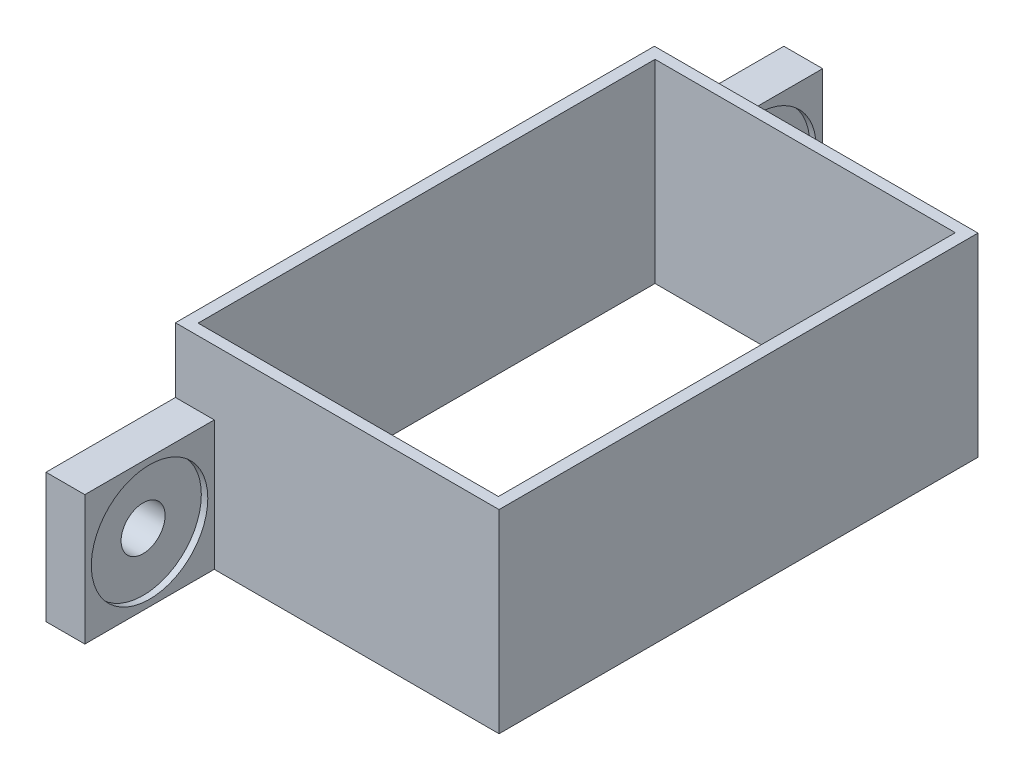
ISO-10303-21;
HEADER;
FILE_DESCRIPTION(('STEP AP214'),'2;1');
FILE_NAME('part.step','',(''),(''),'','','');
FILE_SCHEMA(('AUTOMOTIVE_DESIGN { 1 0 10303 214 1 1 1 1 }'));
ENDSEC;
DATA;
#1=APPLICATION_CONTEXT('core data for automotive mechanical design processes');
#2=APPLICATION_PROTOCOL_DEFINITION('international standard','automotive_design',2000,#1);
#3=PRODUCT_CONTEXT('',#1,'mechanical');
#4=PRODUCT('Part','Part','',(#3));
#5=PRODUCT_RELATED_PRODUCT_CATEGORY('part','',(#4));
#6=PRODUCT_DEFINITION_FORMATION('','',#4);
#7=PRODUCT_DEFINITION_CONTEXT('part definition',#1,'design');
#8=PRODUCT_DEFINITION('design','',#6,#7);
#9=PRODUCT_DEFINITION_SHAPE('','',#8);
#10=(LENGTH_UNIT() NAMED_UNIT(*) SI_UNIT(.MILLI.,.METRE.));
#11=(NAMED_UNIT(*) PLANE_ANGLE_UNIT() SI_UNIT($,.RADIAN.));
#12=(NAMED_UNIT(*) SI_UNIT($,.STERADIAN.) SOLID_ANGLE_UNIT());
#13=UNCERTAINTY_MEASURE_WITH_UNIT(LENGTH_MEASURE(1.E-05),#10,'distance_accuracy_value','');
#14=(GEOMETRIC_REPRESENTATION_CONTEXT(3) GLOBAL_UNCERTAINTY_ASSIGNED_CONTEXT((#13)) GLOBAL_UNIT_ASSIGNED_CONTEXT((#10,
#11,#12)) REPRESENTATION_CONTEXT('',''));
#15=CARTESIAN_POINT('',(0.,0.,0.));
#16=DIRECTION('',(0.,0.,1.));
#17=DIRECTION('',(1.,0.,0.));
#18=AXIS2_PLACEMENT_3D('',#15,#16,#17);
#19=CARTESIAN_POINT('',(-88.7261701767557,20.,7.55517570960751));
#20=DIRECTION('',(0.,0.,-1.));
#21=DIRECTION('',(-1.,0.,0.));
#22=AXIS2_PLACEMENT_3D('',#19,#20,#21);
#23=PLANE('',#22);
#24=DIRECTION('',(1.,0.,0.));
#25=VECTOR('',#24,1.);
#26=CARTESIAN_POINT('',(-88.7261701767557,5.,7.55517570960751));
#27=LINE('',#26,#25);
#28=CARTESIAN_POINT('',(-85.7261701767557,5.,7.55517570960751));
#29=VERTEX_POINT('',#28);
#30=CARTESIAN_POINT('',(-63.7261701767557,5.,7.55517570960751));
#31=VERTEX_POINT('',#30);
#32=EDGE_CURVE('E144',#29,#31,#27,.T.);
#33=ORIENTED_EDGE('',*,*,#32,.T.);
#34=DIRECTION('',(0.,-1.,0.));
#35=VECTOR('',#34,1.);
#36=CARTESIAN_POINT('',(-63.7261701767557,20.,7.55517570960751));
#37=LINE('',#36,#35);
#38=CARTESIAN_POINT('',(-63.7261701767557,20.,7.55517570960751));
#39=VERTEX_POINT('',#38);
#40=EDGE_CURVE('E158',#39,#31,#37,.T.);
#41=ORIENTED_EDGE('',*,*,#40,.F.);
#42=DIRECTION('',(1.,0.,0.));
#43=VECTOR('',#42,1.);
#44=CARTESIAN_POINT('',(-88.7261701767557,20.,7.55517570960751));
#45=LINE('',#44,#43);
#46=CARTESIAN_POINT('',(-88.7261701767557,20.,7.55517570960751));
#47=VERTEX_POINT('',#46);
#48=EDGE_CURVE('E182',#47,#39,#45,.T.);
#49=ORIENTED_EDGE('',*,*,#48,.F.);
#50=DIRECTION('',(0.,-1.,0.));
#51=VECTOR('',#50,1.);
#52=CARTESIAN_POINT('',(-88.7261701767557,20.,7.55517570960751));
#53=LINE('',#52,#51);
#54=CARTESIAN_POINT('',(-88.7261701767557,15.,7.55517570960751));
#55=VERTEX_POINT('',#54);
#56=EDGE_CURVE('E167',#47,#55,#53,.T.);
#57=ORIENTED_EDGE('',*,*,#56,.T.);
#58=DIRECTION('',(-1.,0.,0.));
#59=VECTOR('',#58,1.);
#60=CARTESIAN_POINT('',(-85.7261701767557,15.,7.55517570960751));
#61=LINE('',#60,#59);
#62=CARTESIAN_POINT('',(-85.7261701767557,15.,7.55517570960751));
#63=VERTEX_POINT('',#62);
#64=EDGE_CURVE('E239',#63,#55,#61,.T.);
#65=ORIENTED_EDGE('',*,*,#64,.F.);
#66=DIRECTION('',(0.,-1.,0.));
#67=VECTOR('',#66,1.);
#68=CARTESIAN_POINT('',(-85.7261701767557,15.,7.55517570960751));
#69=LINE('',#68,#67);
#70=EDGE_CURVE('E161',#63,#29,#69,.T.);
#71=ORIENTED_EDGE('',*,*,#70,.T.);
#72=EDGE_LOOP('',(#33,#41,#49,#57,#65,#71));
#73=FACE_BOUND('',#72,.T.);
#74=ADVANCED_FACE('F39',(#73),#23,.F.);
#75=CARTESIAN_POINT('',(-88.7261701767557,20.,-29.4448242903925));
#76=DIRECTION('',(0.,0.,-1.));
#77=DIRECTION('',(-1.,0.,0.));
#78=AXIS2_PLACEMENT_3D('',#75,#76,#77);
#79=PLANE('',#78);
#80=DIRECTION('',(0.,-1.,0.));
#81=VECTOR('',#80,1.);
#82=CARTESIAN_POINT('',(-63.7261701767557,20.,-29.4448242903925));
#83=LINE('',#82,#81);
#84=CARTESIAN_POINT('',(-63.7261701767557,20.,-29.4448242903925));
#85=VERTEX_POINT('',#84);
#86=CARTESIAN_POINT('',(-63.7261701767557,5.,-29.4448242903925));
#87=VERTEX_POINT('',#86);
#88=EDGE_CURVE('E168',#85,#87,#83,.T.);
#89=ORIENTED_EDGE('',*,*,#88,.T.);
#90=DIRECTION('',(1.,0.,0.));
#91=VECTOR('',#90,1.);
#92=CARTESIAN_POINT('',(-88.7261701767557,5.,-29.4448242903925));
#93=LINE('',#92,#91);
#94=CARTESIAN_POINT('',(-85.7261701767557,5.,-29.4448242903925));
#95=VERTEX_POINT('',#94);
#96=EDGE_CURVE('E147',#95,#87,#93,.T.);
#97=ORIENTED_EDGE('',*,*,#96,.F.);
#98=DIRECTION('',(0.,1.,0.));
#99=VECTOR('',#98,1.);
#100=CARTESIAN_POINT('',(-85.7261701767557,15.,-29.4448242903925));
#101=LINE('',#100,#99);
#102=CARTESIAN_POINT('',(-85.7261701767557,15.,-29.4448242903925));
#103=VERTEX_POINT('',#102);
#104=EDGE_CURVE('E232',#95,#103,#101,.T.);
#105=ORIENTED_EDGE('',*,*,#104,.T.);
#106=DIRECTION('',(-1.,0.,0.));
#107=VECTOR('',#106,1.);
#108=CARTESIAN_POINT('',(-85.7261701767557,15.,-29.4448242903925));
#109=LINE('',#108,#107);
#110=CARTESIAN_POINT('',(-88.7261701767557,15.,-29.4448242903925));
#111=VERTEX_POINT('',#110);
#112=EDGE_CURVE('E220',#103,#111,#109,.T.);
#113=ORIENTED_EDGE('',*,*,#112,.T.);
#114=DIRECTION('',(0.,-1.,0.));
#115=VECTOR('',#114,1.);
#116=CARTESIAN_POINT('',(-88.7261701767557,20.,-29.4448242903925));
#117=LINE('',#116,#115);
#118=CARTESIAN_POINT('',(-88.7261701767557,20.,-29.4448242903925));
#119=VERTEX_POINT('',#118);
#120=EDGE_CURVE('E48',#119,#111,#117,.T.);
#121=ORIENTED_EDGE('',*,*,#120,.F.);
#122=DIRECTION('',(1.,0.,0.));
#123=VECTOR('',#122,1.);
#124=CARTESIAN_POINT('',(-88.7261701767557,20.,-29.4448242903925));
#125=LINE('',#124,#123);
#126=EDGE_CURVE('E187',#119,#85,#125,.T.);
#127=ORIENTED_EDGE('',*,*,#126,.T.);
#128=EDGE_LOOP('',(#89,#97,#105,#113,#121,#127));
#129=FACE_BOUND('',#128,.T.);
#130=ADVANCED_FACE('F41',(#129),#79,.T.);
#131=CARTESIAN_POINT('',(-88.7261701767557,20.,7.55517570960751));
#132=DIRECTION('',(-1.,0.,0.));
#133=DIRECTION('',(0.,0.,1.));
#134=AXIS2_PLACEMENT_3D('',#131,#132,#133);
#135=PLANE('',#134);
#136=CARTESIAN_POINT('',(-88.7261701767557,10.,-34.4448242903925));
#137=DIRECTION('',(1.,0.,0.));
#138=DIRECTION('',(0.,0.,-1.));
#139=AXIS2_PLACEMENT_3D('',#136,#137,#138);
#140=CIRCLE('',#139,1.7);
#141=CARTESIAN_POINT('',(-88.7261701767557,10.,-36.1448242903925));
#142=VERTEX_POINT('',#141);
#143=EDGE_CURVE('E299',#142,#142,#140,.T.);
#144=ORIENTED_EDGE('',*,*,#143,.T.);
#145=EDGE_LOOP('',(#144));
#146=FACE_BOUND('',#145,.T.);
#147=CARTESIAN_POINT('',(-88.7261701767555,10.,12.5551757096075));
#148=DIRECTION('',(1.,0.,0.));
#149=DIRECTION('',(0.,0.,-1.));
#150=AXIS2_PLACEMENT_3D('',#147,#148,#149);
#151=CIRCLE('',#150,1.7);
#152=CARTESIAN_POINT('',(-88.7261701767555,10.,10.8551757096075));
#153=VERTEX_POINT('',#152);
#154=EDGE_CURVE('E271',#153,#153,#151,.T.);
#155=ORIENTED_EDGE('',*,*,#154,.T.);
#156=EDGE_LOOP('',(#155));
#157=FACE_BOUND('',#156,.T.);
#158=DIRECTION('',(0.,0.,1.));
#159=VECTOR('',#158,1.);
#160=CARTESIAN_POINT('',(-88.7261701767557,5.,-29.4448242903925));
#161=LINE('',#160,#159);
#162=CARTESIAN_POINT('',(-88.7261701767557,5.,-39.4448242903925));
#163=VERTEX_POINT('',#162);
#164=CARTESIAN_POINT('',(-88.7261701767557,5.,17.5551757096075));
#165=VERTEX_POINT('',#164);
#166=EDGE_CURVE('E229',#163,#165,#161,.T.);
#167=ORIENTED_EDGE('',*,*,#166,.T.);
#168=DIRECTION('',(0.,1.,0.));
#169=VECTOR('',#168,1.);
#170=CARTESIAN_POINT('',(-88.7261701767557,15.,17.5551757096075));
#171=LINE('',#170,#169);
#172=CARTESIAN_POINT('',(-88.7261701767557,15.,17.5551757096075));
#173=VERTEX_POINT('',#172);
#174=EDGE_CURVE('E267',#165,#173,#171,.T.);
#175=ORIENTED_EDGE('',*,*,#174,.T.);
#176=DIRECTION('',(0.,0.,-1.));
#177=VECTOR('',#176,1.);
#178=CARTESIAN_POINT('',(-88.7261701767557,15.,7.55517570960751));
#179=LINE('',#178,#177);
#180=EDGE_CURVE('E263',#173,#55,#179,.T.);
#181=ORIENTED_EDGE('',*,*,#180,.T.);
#182=ORIENTED_EDGE('',*,*,#56,.F.);
#183=DIRECTION('',(0.,0.,-1.));
#184=VECTOR('',#183,1.);
#185=CARTESIAN_POINT('',(-88.7261701767557,20.,7.55517570960751));
#186=LINE('',#185,#184);
#187=EDGE_CURVE('E174',#47,#119,#186,.T.);
#188=ORIENTED_EDGE('',*,*,#187,.T.);
#189=ORIENTED_EDGE('',*,*,#120,.T.);
#190=DIRECTION('',(0.,0.,-1.));
#191=VECTOR('',#190,1.);
#192=CARTESIAN_POINT('',(-88.7261701767557,15.,-29.4448242903925));
#193=LINE('',#192,#191);
#194=CARTESIAN_POINT('',(-88.7261701767557,15.,-39.4448242903925));
#195=VERTEX_POINT('',#194);
#196=EDGE_CURVE('E62',#111,#195,#193,.T.);
#197=ORIENTED_EDGE('',*,*,#196,.T.);
#198=DIRECTION('',(0.,-1.,0.));
#199=VECTOR('',#198,1.);
#200=CARTESIAN_POINT('',(-88.7261701767557,15.,-39.4448242903925));
#201=LINE('',#200,#199);
#202=EDGE_CURVE('E233',#195,#163,#201,.T.);
#203=ORIENTED_EDGE('',*,*,#202,.T.);
#204=EDGE_LOOP('',(#167,#175,#181,#182,#188,#189,#197,#203));
#205=FACE_BOUND('',#204,.T.);
#206=ADVANCED_FACE('F359',(#146,#157,#205),#135,.T.);
#207=CARTESIAN_POINT('',(-63.7261701767557,20.,7.55517570960751));
#208=DIRECTION('',(-1.,0.,0.));
#209=DIRECTION('',(0.,0.,1.));
#210=AXIS2_PLACEMENT_3D('',#207,#208,#209);
#211=PLANE('',#210);
#212=DIRECTION('',(0.,0.,1.));
#213=VECTOR('',#212,1.);
#214=CARTESIAN_POINT('',(-63.7261701767557,5.,-29.4448242903925));
#215=LINE('',#214,#213);
#216=EDGE_CURVE('E139',#87,#31,#215,.T.);
#217=ORIENTED_EDGE('',*,*,#216,.F.);
#218=ORIENTED_EDGE('',*,*,#88,.F.);
#219=DIRECTION('',(0.,0.,-1.));
#220=VECTOR('',#219,1.);
#221=CARTESIAN_POINT('',(-63.7261701767557,20.,7.55517570960751));
#222=LINE('',#221,#220);
#223=EDGE_CURVE('E165',#39,#85,#222,.T.);
#224=ORIENTED_EDGE('',*,*,#223,.F.);
#225=ORIENTED_EDGE('',*,*,#40,.T.);
#226=EDGE_LOOP('',(#217,#218,#224,#225));
#227=FACE_BOUND('',#226,.T.);
#228=ADVANCED_FACE('F164',(#227),#211,.F.);
#229=CARTESIAN_POINT('',(-87.8261701767557,2.,-28.5948242903925));
#230=DIRECTION('',(-1.,0.,0.));
#231=DIRECTION('',(0.,0.,1.));
#232=AXIS2_PLACEMENT_3D('',#229,#230,#231);
#233=PLANE('',#232);
#234=DIRECTION('',(0.,0.,1.));
#235=VECTOR('',#234,1.);
#236=CARTESIAN_POINT('',(-87.8261701767557,5.,-28.5948242903925));
#237=LINE('',#236,#235);
#238=CARTESIAN_POINT('',(-87.8261701767557,5.,-28.5948242903925));
#239=VERTEX_POINT('',#238);
#240=CARTESIAN_POINT('',(-87.8261701767557,5.,6.70517570960751));
#241=VERTEX_POINT('',#240);
#242=EDGE_CURVE('E54',#239,#241,#237,.T.);
#243=ORIENTED_EDGE('',*,*,#242,.F.);
#244=DIRECTION('',(0.,1.,0.));
#245=VECTOR('',#244,1.);
#246=CARTESIAN_POINT('',(-87.8261701767557,2.,-28.5948242903925));
#247=LINE('',#246,#245);
#248=CARTESIAN_POINT('',(-87.8261701767557,20.,-28.5948242903925));
#249=VERTEX_POINT('',#248);
#250=EDGE_CURVE('E191',#239,#249,#247,.T.);
#251=ORIENTED_EDGE('',*,*,#250,.T.);
#252=DIRECTION('',(0.,0.,1.));
#253=VECTOR('',#252,1.);
#254=CARTESIAN_POINT('',(-87.8261701767557,20.,-28.5948242903925));
#255=LINE('',#254,#253);
#256=CARTESIAN_POINT('',(-87.8261701767557,20.,6.70517570960751));
#257=VERTEX_POINT('',#256);
#258=EDGE_CURVE('E215',#249,#257,#255,.T.);
#259=ORIENTED_EDGE('',*,*,#258,.T.);
#260=DIRECTION('',(0.,1.,0.));
#261=VECTOR('',#260,1.);
#262=CARTESIAN_POINT('',(-87.8261701767557,2.,6.70517570960751));
#263=LINE('',#262,#261);
#264=EDGE_CURVE('E192',#241,#257,#263,.T.);
#265=ORIENTED_EDGE('',*,*,#264,.F.);
#266=EDGE_LOOP('',(#243,#251,#259,#265));
#267=FACE_BOUND('',#266,.T.);
#268=ADVANCED_FACE('F342',(#267),#233,.F.);
#269=CARTESIAN_POINT('',(-87.8261701767557,2.,-28.5948242903925));
#270=DIRECTION('',(0.,0.,-1.));
#271=DIRECTION('',(-1.,0.,0.));
#272=AXIS2_PLACEMENT_3D('',#269,#270,#271);
#273=PLANE('',#272);
#274=DIRECTION('',(-1.,0.,0.));
#275=VECTOR('',#274,1.);
#276=CARTESIAN_POINT('',(-87.8261701767557,5.,-28.5948242903925));
#277=LINE('',#276,#275);
#278=CARTESIAN_POINT('',(-64.6261701767557,5.,-28.5948242903925));
#279=VERTEX_POINT('',#278);
#280=EDGE_CURVE('E317',#279,#239,#277,.T.);
#281=ORIENTED_EDGE('',*,*,#280,.F.);
#282=DIRECTION('',(0.,1.,0.));
#283=VECTOR('',#282,1.);
#284=CARTESIAN_POINT('',(-64.6261701767557,2.,-28.5948242903925));
#285=LINE('',#284,#283);
#286=CARTESIAN_POINT('',(-64.6261701767557,20.,-28.5948242903925));
#287=VERTEX_POINT('',#286);
#288=EDGE_CURVE('E199',#279,#287,#285,.T.);
#289=ORIENTED_EDGE('',*,*,#288,.T.);
#290=DIRECTION('',(-1.,0.,0.));
#291=VECTOR('',#290,1.);
#292=CARTESIAN_POINT('',(-87.8261701767557,20.,-28.5948242903925));
#293=LINE('',#292,#291);
#294=EDGE_CURVE('E196',#287,#249,#293,.T.);
#295=ORIENTED_EDGE('',*,*,#294,.T.);
#296=ORIENTED_EDGE('',*,*,#250,.F.);
#297=EDGE_LOOP('',(#281,#289,#295,#296));
#298=FACE_BOUND('',#297,.T.);
#299=ADVANCED_FACE('F331',(#298),#273,.F.);
#300=CARTESIAN_POINT('',(-64.6261701767557,2.,-28.5948242903925));
#301=DIRECTION('',(1.,0.,0.));
#302=DIRECTION('',(0.,0.,-1.));
#303=AXIS2_PLACEMENT_3D('',#300,#301,#302);
#304=PLANE('',#303);
#305=DIRECTION('',(0.,0.,-1.));
#306=VECTOR('',#305,1.);
#307=CARTESIAN_POINT('',(-64.6261701767557,5.,-28.5948242903925));
#308=LINE('',#307,#306);
#309=CARTESIAN_POINT('',(-64.6261701767557,5.,6.70517570960751));
#310=VERTEX_POINT('',#309);
#311=EDGE_CURVE('E320',#310,#279,#308,.T.);
#312=ORIENTED_EDGE('',*,*,#311,.F.);
#313=DIRECTION('',(0.,1.,0.));
#314=VECTOR('',#313,1.);
#315=CARTESIAN_POINT('',(-64.6261701767557,2.,6.70517570960751));
#316=LINE('',#315,#314);
#317=CARTESIAN_POINT('',(-64.6261701767557,20.,6.70517570960751));
#318=VERTEX_POINT('',#317);
#319=EDGE_CURVE('E195',#310,#318,#316,.T.);
#320=ORIENTED_EDGE('',*,*,#319,.T.);
#321=DIRECTION('',(0.,0.,-1.));
#322=VECTOR('',#321,1.);
#323=CARTESIAN_POINT('',(-64.6261701767557,20.,-28.5948242903925));
#324=LINE('',#323,#322);
#325=EDGE_CURVE('E207',#318,#287,#324,.T.);
#326=ORIENTED_EDGE('',*,*,#325,.T.);
#327=ORIENTED_EDGE('',*,*,#288,.F.);
#328=EDGE_LOOP('',(#312,#320,#326,#327));
#329=FACE_BOUND('',#328,.T.);
#330=ADVANCED_FACE('F332',(#329),#304,.F.);
#331=CARTESIAN_POINT('',(-87.8261701767557,2.,6.70517570960751));
#332=DIRECTION('',(0.,0.,1.));
#333=DIRECTION('',(1.,0.,0.));
#334=AXIS2_PLACEMENT_3D('',#331,#332,#333);
#335=PLANE('',#334);
#336=DIRECTION('',(1.,0.,0.));
#337=VECTOR('',#336,1.);
#338=CARTESIAN_POINT('',(-87.8261701767557,5.,6.70517570960751));
#339=LINE('',#338,#337);
#340=EDGE_CURVE('E11',#241,#310,#339,.T.);
#341=ORIENTED_EDGE('',*,*,#340,.F.);
#342=ORIENTED_EDGE('',*,*,#264,.T.);
#343=DIRECTION('',(1.,0.,0.));
#344=VECTOR('',#343,1.);
#345=CARTESIAN_POINT('',(-87.8261701767557,20.,6.70517570960751));
#346=LINE('',#345,#344);
#347=EDGE_CURVE('E211',#257,#318,#346,.T.);
#348=ORIENTED_EDGE('',*,*,#347,.T.);
#349=ORIENTED_EDGE('',*,*,#319,.F.);
#350=EDGE_LOOP('',(#341,#342,#348,#349));
#351=FACE_BOUND('',#350,.T.);
#352=ADVANCED_FACE('F344',(#351),#335,.F.);
#353=CARTESIAN_POINT('',(0.,20.,0.));
#354=DIRECTION('',(0.,1.,0.));
#355=DIRECTION('',(0.,0.,1.));
#356=AXIS2_PLACEMENT_3D('',#353,#354,#355);
#357=PLANE('',#356);
#358=ORIENTED_EDGE('',*,*,#258,.F.);
#359=ORIENTED_EDGE('',*,*,#294,.F.);
#360=ORIENTED_EDGE('',*,*,#325,.F.);
#361=ORIENTED_EDGE('',*,*,#347,.F.);
#362=EDGE_LOOP('',(#358,#359,#360,#361));
#363=FACE_BOUND('',#362,.T.);
#364=ORIENTED_EDGE('',*,*,#126,.F.);
#365=ORIENTED_EDGE('',*,*,#187,.F.);
#366=ORIENTED_EDGE('',*,*,#48,.T.);
#367=ORIENTED_EDGE('',*,*,#223,.T.);
#368=EDGE_LOOP('',(#364,#365,#366,#367));
#369=FACE_BOUND('',#368,.T.);
#370=ADVANCED_FACE('F338',(#363,#369),#357,.T.);
#371=CARTESIAN_POINT('',(-85.7261701767557,5.,-29.4448242903925));
#372=DIRECTION('',(0.,-1.,0.));
#373=DIRECTION('',(0.,0.,-1.));
#374=AXIS2_PLACEMENT_3D('',#371,#372,#373);
#375=PLANE('',#374);
#376=ORIENTED_EDGE('',*,*,#166,.F.);
#377=DIRECTION('',(-1.,0.,0.));
#378=VECTOR('',#377,1.);
#379=CARTESIAN_POINT('',(-85.7261701767557,5.,-39.4448242903925));
#380=LINE('',#379,#378);
#381=CARTESIAN_POINT('',(-85.7261701767557,5.,-39.4448242903925));
#382=VERTEX_POINT('',#381);
#383=EDGE_CURVE('E219',#382,#163,#380,.T.);
#384=ORIENTED_EDGE('',*,*,#383,.F.);
#385=DIRECTION('',(0.,0.,1.));
#386=VECTOR('',#385,1.);
#387=CARTESIAN_POINT('',(-85.7261701767557,5.,-29.4448242903925));
#388=LINE('',#387,#386);
#389=EDGE_CURVE('E224',#382,#95,#388,.T.);
#390=ORIENTED_EDGE('',*,*,#389,.T.);
#391=ORIENTED_EDGE('',*,*,#96,.T.);
#392=ORIENTED_EDGE('',*,*,#216,.T.);
#393=ORIENTED_EDGE('',*,*,#32,.F.);
#394=DIRECTION('',(0.,0.,1.));
#395=VECTOR('',#394,1.);
#396=CARTESIAN_POINT('',(-85.7261701767557,5.,7.55517570960751));
#397=LINE('',#396,#395);
#398=CARTESIAN_POINT('',(-85.7261701767557,5.,17.5551757096075));
#399=VERTEX_POINT('',#398);
#400=EDGE_CURVE('E279',#29,#399,#397,.T.);
#401=ORIENTED_EDGE('',*,*,#400,.T.);
#402=DIRECTION('',(-1.,0.,0.));
#403=VECTOR('',#402,1.);
#404=CARTESIAN_POINT('',(-85.7261701767557,5.,17.5551757096075));
#405=LINE('',#404,#403);
#406=EDGE_CURVE('E253',#399,#165,#405,.T.);
#407=ORIENTED_EDGE('',*,*,#406,.T.);
#408=EDGE_LOOP('',(#376,#384,#390,#391,#392,#393,#401,#407));
#409=FACE_BOUND('',#408,.T.);
#410=ORIENTED_EDGE('',*,*,#242,.T.);
#411=ORIENTED_EDGE('',*,*,#340,.T.);
#412=ORIENTED_EDGE('',*,*,#311,.T.);
#413=ORIENTED_EDGE('',*,*,#280,.T.);
#414=EDGE_LOOP('',(#410,#411,#412,#413));
#415=FACE_BOUND('',#414,.T.);
#416=ADVANCED_FACE('F142',(#409,#415),#375,.T.);
#417=CARTESIAN_POINT('',(-85.7261701767557,15.,-39.4448242903925));
#418=DIRECTION('',(0.,0.,-1.));
#419=DIRECTION('',(-1.,0.,0.));
#420=AXIS2_PLACEMENT_3D('',#417,#418,#419);
#421=PLANE('',#420);
#422=ORIENTED_EDGE('',*,*,#202,.F.);
#423=DIRECTION('',(-1.,0.,0.));
#424=VECTOR('',#423,1.);
#425=CARTESIAN_POINT('',(-85.7261701767557,15.,-39.4448242903925));
#426=LINE('',#425,#424);
#427=CARTESIAN_POINT('',(-85.7261701767557,15.,-39.4448242903925));
#428=VERTEX_POINT('',#427);
#429=EDGE_CURVE('E223',#428,#195,#426,.T.);
#430=ORIENTED_EDGE('',*,*,#429,.F.);
#431=DIRECTION('',(0.,-1.,0.));
#432=VECTOR('',#431,1.);
#433=CARTESIAN_POINT('',(-85.7261701767557,15.,-39.4448242903925));
#434=LINE('',#433,#432);
#435=EDGE_CURVE('E242',#428,#382,#434,.T.);
#436=ORIENTED_EDGE('',*,*,#435,.T.);
#437=ORIENTED_EDGE('',*,*,#383,.T.);
#438=EDGE_LOOP('',(#422,#430,#436,#437));
#439=FACE_BOUND('',#438,.T.);
#440=ADVANCED_FACE('F393',(#439),#421,.T.);
#441=CARTESIAN_POINT('',(-85.7261701767557,15.,-29.4448242903925));
#442=DIRECTION('',(0.,1.,0.));
#443=DIRECTION('',(0.,0.,1.));
#444=AXIS2_PLACEMENT_3D('',#441,#442,#443);
#445=PLANE('',#444);
#446=ORIENTED_EDGE('',*,*,#196,.F.);
#447=ORIENTED_EDGE('',*,*,#112,.F.);
#448=DIRECTION('',(0.,0.,-1.));
#449=VECTOR('',#448,1.);
#450=CARTESIAN_POINT('',(-85.7261701767557,15.,-29.4448242903925));
#451=LINE('',#450,#449);
#452=EDGE_CURVE('E246',#103,#428,#451,.T.);
#453=ORIENTED_EDGE('',*,*,#452,.T.);
#454=ORIENTED_EDGE('',*,*,#429,.T.);
#455=EDGE_LOOP('',(#446,#447,#453,#454));
#456=FACE_BOUND('',#455,.T.);
#457=ADVANCED_FACE('F387',(#456),#445,.T.);
#458=CARTESIAN_POINT('',(-85.7261701767557,0.,0.));
#459=DIRECTION('',(1.,0.,0.));
#460=DIRECTION('',(0.,0.,-1.));
#461=AXIS2_PLACEMENT_3D('',#458,#459,#460);
#462=PLANE('',#461);
#463=CARTESIAN_POINT('',(-85.7261701767557,10.,-34.4448242903925));
#464=DIRECTION('',(1.,0.,0.));
#465=DIRECTION('',(0.,0.,-1.));
#466=AXIS2_PLACEMENT_3D('',#463,#464,#465);
#467=CIRCLE('',#466,4.49999999999999);
#468=CARTESIAN_POINT('',(-85.7261701767557,10.,-38.9448242903925));
#469=VERTEX_POINT('',#468);
#470=EDGE_CURVE('E311',#469,#469,#467,.T.);
#471=ORIENTED_EDGE('',*,*,#470,.F.);
#472=EDGE_LOOP('',(#471));
#473=FACE_BOUND('',#472,.T.);
#474=ORIENTED_EDGE('',*,*,#104,.F.);
#475=ORIENTED_EDGE('',*,*,#389,.F.);
#476=ORIENTED_EDGE('',*,*,#435,.F.);
#477=ORIENTED_EDGE('',*,*,#452,.F.);
#478=EDGE_LOOP('',(#474,#475,#476,#477));
#479=FACE_BOUND('',#478,.T.);
#480=ADVANCED_FACE('F390',(#473,#479),#462,.T.);
#481=CARTESIAN_POINT('',(-85.7261701767557,15.,7.55517570960751));
#482=DIRECTION('',(0.,1.,0.));
#483=DIRECTION('',(0.,0.,1.));
#484=AXIS2_PLACEMENT_3D('',#481,#482,#483);
#485=PLANE('',#484);
#486=ORIENTED_EDGE('',*,*,#180,.F.);
#487=DIRECTION('',(-1.,0.,0.));
#488=VECTOR('',#487,1.);
#489=CARTESIAN_POINT('',(-85.7261701767557,15.,17.5551757096075));
#490=LINE('',#489,#488);
#491=CARTESIAN_POINT('',(-85.7261701767557,15.,17.5551757096075));
#492=VERTEX_POINT('',#491);
#493=EDGE_CURVE('E257',#492,#173,#490,.T.);
#494=ORIENTED_EDGE('',*,*,#493,.F.);
#495=DIRECTION('',(0.,0.,-1.));
#496=VECTOR('',#495,1.);
#497=CARTESIAN_POINT('',(-85.7261701767557,15.,7.55517570960751));
#498=LINE('',#497,#496);
#499=EDGE_CURVE('E258',#492,#63,#498,.T.);
#500=ORIENTED_EDGE('',*,*,#499,.T.);
#501=ORIENTED_EDGE('',*,*,#64,.T.);
#502=EDGE_LOOP('',(#486,#494,#500,#501));
#503=FACE_BOUND('',#502,.T.);
#504=ADVANCED_FACE('F382',(#503),#485,.T.);
#505=CARTESIAN_POINT('',(-85.7261701767557,15.,17.5551757096075));
#506=DIRECTION('',(0.,0.,1.));
#507=DIRECTION('',(0.,-1.,0.));
#508=AXIS2_PLACEMENT_3D('',#505,#506,#507);
#509=PLANE('',#508);
#510=ORIENTED_EDGE('',*,*,#174,.F.);
#511=ORIENTED_EDGE('',*,*,#406,.F.);
#512=DIRECTION('',(0.,1.,0.));
#513=VECTOR('',#512,1.);
#514=CARTESIAN_POINT('',(-85.7261701767557,15.,17.5551757096075));
#515=LINE('',#514,#513);
#516=EDGE_CURVE('E275',#399,#492,#515,.T.);
#517=ORIENTED_EDGE('',*,*,#516,.T.);
#518=ORIENTED_EDGE('',*,*,#493,.T.);
#519=EDGE_LOOP('',(#510,#511,#517,#518));
#520=FACE_BOUND('',#519,.T.);
#521=ADVANCED_FACE('F379',(#520),#509,.T.);
#522=CARTESIAN_POINT('',(-85.7261701767557,0.,0.));
#523=DIRECTION('',(-1.,0.,0.));
#524=DIRECTION('',(0.,0.,1.));
#525=AXIS2_PLACEMENT_3D('',#522,#523,#524);
#526=PLANE('',#525);
#527=CARTESIAN_POINT('',(-85.7261701767555,10.,12.5551757096075));
#528=DIRECTION('',(1.,0.,0.));
#529=DIRECTION('',(0.,0.,-1.));
#530=AXIS2_PLACEMENT_3D('',#527,#528,#529);
#531=CIRCLE('',#530,4.49999999999999);
#532=CARTESIAN_POINT('',(-85.7261701767555,10.,8.05517570960753));
#533=VERTEX_POINT('',#532);
#534=EDGE_CURVE('E295',#533,#533,#531,.T.);
#535=ORIENTED_EDGE('',*,*,#534,.F.);
#536=EDGE_LOOP('',(#535));
#537=FACE_BOUND('',#536,.T.);
#538=ORIENTED_EDGE('',*,*,#70,.F.);
#539=ORIENTED_EDGE('',*,*,#499,.F.);
#540=ORIENTED_EDGE('',*,*,#516,.F.);
#541=ORIENTED_EDGE('',*,*,#400,.F.);
#542=EDGE_LOOP('',(#538,#539,#540,#541));
#543=FACE_BOUND('',#542,.T.);
#544=ADVANCED_FACE('F441',(#537,#543),#526,.F.);
#545=CARTESIAN_POINT('',(-85.7261701767555,10.,12.5551757096075));
#546=DIRECTION('',(1.,0.,0.));
#547=DIRECTION('',(0.,0.,-1.));
#548=AXIS2_PLACEMENT_3D('',#545,#546,#547);
#549=CYLINDRICAL_SURFACE('',#548,1.70000000000001);
#550=ORIENTED_EDGE('',*,*,#154,.F.);
#551=EDGE_LOOP('',(#550));
#552=FACE_BOUND('',#551,.T.);
#553=CARTESIAN_POINT('',(-86.2261701767555,10.,12.5551757096075));
#554=DIRECTION('',(1.,0.,0.));
#555=DIRECTION('',(0.,0.,-1.));
#556=AXIS2_PLACEMENT_3D('',#553,#554,#555);
#557=CIRCLE('',#556,1.70000000000001);
#558=CARTESIAN_POINT('',(-86.2261701767555,10.,10.8551757096075));
#559=VERTEX_POINT('',#558);
#560=EDGE_CURVE('E287',#559,#559,#557,.T.);
#561=ORIENTED_EDGE('',*,*,#560,.T.);
#562=EDGE_LOOP('',(#561));
#563=FACE_BOUND('',#562,.T.);
#564=ADVANCED_FACE('F445',(#552,#563),#549,.F.);
#565=CARTESIAN_POINT('',(-86.2261701767555,11.7,12.5551757096075));
#566=DIRECTION('',(-1.,0.,0.));
#567=DIRECTION('',(0.,0.,1.));
#568=AXIS2_PLACEMENT_3D('',#565,#566,#567);
#569=PLANE('',#568);
#570=ORIENTED_EDGE('',*,*,#560,.F.);
#571=EDGE_LOOP('',(#570));
#572=FACE_BOUND('',#571,.T.);
#573=CARTESIAN_POINT('',(-86.2261701767555,10.,12.5551757096075));
#574=DIRECTION('',(1.,0.,0.));
#575=DIRECTION('',(0.,0.,-1.));
#576=AXIS2_PLACEMENT_3D('',#573,#574,#575);
#577=CIRCLE('',#576,4.49999999999999);
#578=CARTESIAN_POINT('',(-86.2261701767555,10.,8.05517570960753));
#579=VERTEX_POINT('',#578);
#580=EDGE_CURVE('E291',#579,#579,#577,.T.);
#581=ORIENTED_EDGE('',*,*,#580,.T.);
#582=EDGE_LOOP('',(#581));
#583=FACE_BOUND('',#582,.T.);
#584=ADVANCED_FACE('F460',(#572,#583),#569,.F.);
#585=CARTESIAN_POINT('',(-85.7261701767555,10.,12.5551757096075));
#586=DIRECTION('',(1.,0.,0.));
#587=DIRECTION('',(0.,0.,-1.));
#588=AXIS2_PLACEMENT_3D('',#585,#586,#587);
#589=CYLINDRICAL_SURFACE('',#588,4.49999999999999);
#590=ORIENTED_EDGE('',*,*,#580,.F.);
#591=EDGE_LOOP('',(#590));
#592=FACE_BOUND('',#591,.T.);
#593=ORIENTED_EDGE('',*,*,#534,.T.);
#594=EDGE_LOOP('',(#593));
#595=FACE_BOUND('',#594,.T.);
#596=ADVANCED_FACE('F467',(#592,#595),#589,.F.);
#597=CARTESIAN_POINT('',(-85.7261701767557,10.,-34.4448242903925));
#598=DIRECTION('',(1.,0.,0.));
#599=DIRECTION('',(0.,0.,-1.));
#600=AXIS2_PLACEMENT_3D('',#597,#598,#599);
#601=CYLINDRICAL_SURFACE('',#600,1.70000000000001);
#602=ORIENTED_EDGE('',*,*,#143,.F.);
#603=EDGE_LOOP('',(#602));
#604=FACE_BOUND('',#603,.T.);
#605=CARTESIAN_POINT('',(-86.2261701767557,10.,-34.4448242903925));
#606=DIRECTION('',(1.,0.,0.));
#607=DIRECTION('',(0.,0.,-1.));
#608=AXIS2_PLACEMENT_3D('',#605,#606,#607);
#609=CIRCLE('',#608,1.70000000000001);
#610=CARTESIAN_POINT('',(-86.2261701767557,10.,-36.1448242903925));
#611=VERTEX_POINT('',#610);
#612=EDGE_CURVE('E303',#611,#611,#609,.T.);
#613=ORIENTED_EDGE('',*,*,#612,.T.);
#614=EDGE_LOOP('',(#613));
#615=FACE_BOUND('',#614,.T.);
#616=ADVANCED_FACE('F475',(#604,#615),#601,.F.);
#617=CARTESIAN_POINT('',(-86.2261701767557,11.7,-34.4448242903925));
#618=DIRECTION('',(-1.,0.,0.));
#619=DIRECTION('',(0.,0.,1.));
#620=AXIS2_PLACEMENT_3D('',#617,#618,#619);
#621=PLANE('',#620);
#622=ORIENTED_EDGE('',*,*,#612,.F.);
#623=EDGE_LOOP('',(#622));
#624=FACE_BOUND('',#623,.T.);
#625=CARTESIAN_POINT('',(-86.2261701767557,10.,-34.4448242903925));
#626=DIRECTION('',(1.,0.,0.));
#627=DIRECTION('',(0.,0.,-1.));
#628=AXIS2_PLACEMENT_3D('',#625,#626,#627);
#629=CIRCLE('',#628,4.49999999999999);
#630=CARTESIAN_POINT('',(-86.2261701767557,10.,-38.9448242903925));
#631=VERTEX_POINT('',#630);
#632=EDGE_CURVE('E307',#631,#631,#629,.T.);
#633=ORIENTED_EDGE('',*,*,#632,.T.);
#634=EDGE_LOOP('',(#633));
#635=FACE_BOUND('',#634,.T.);
#636=ADVANCED_FACE('F483',(#624,#635),#621,.F.);
#637=CARTESIAN_POINT('',(-85.7261701767557,10.,-34.4448242903925));
#638=DIRECTION('',(1.,0.,0.));
#639=DIRECTION('',(0.,0.,-1.));
#640=AXIS2_PLACEMENT_3D('',#637,#638,#639);
#641=CYLINDRICAL_SURFACE('',#640,4.49999999999999);
#642=ORIENTED_EDGE('',*,*,#632,.F.);
#643=EDGE_LOOP('',(#642));
#644=FACE_BOUND('',#643,.T.);
#645=ORIENTED_EDGE('',*,*,#470,.T.);
#646=EDGE_LOOP('',(#645));
#647=FACE_BOUND('',#646,.T.);
#648=ADVANCED_FACE('F491',(#644,#647),#641,.F.);
#649=CLOSED_SHELL('',(#74,#130,#206,#228,#268,#299,#330,#352,#370,#416,#440,#457,#480,#504,#521,
#544,#564,#584,#596,#616,#636,#648));
#650=MANIFOLD_SOLID_BREP('B2',#649);
#651=ADVANCED_BREP_SHAPE_REPRESENTATION('',(#18,#650),#14);
#652=SHAPE_DEFINITION_REPRESENTATION(#9,#651);
ENDSEC;
END-ISO-10303-21;
